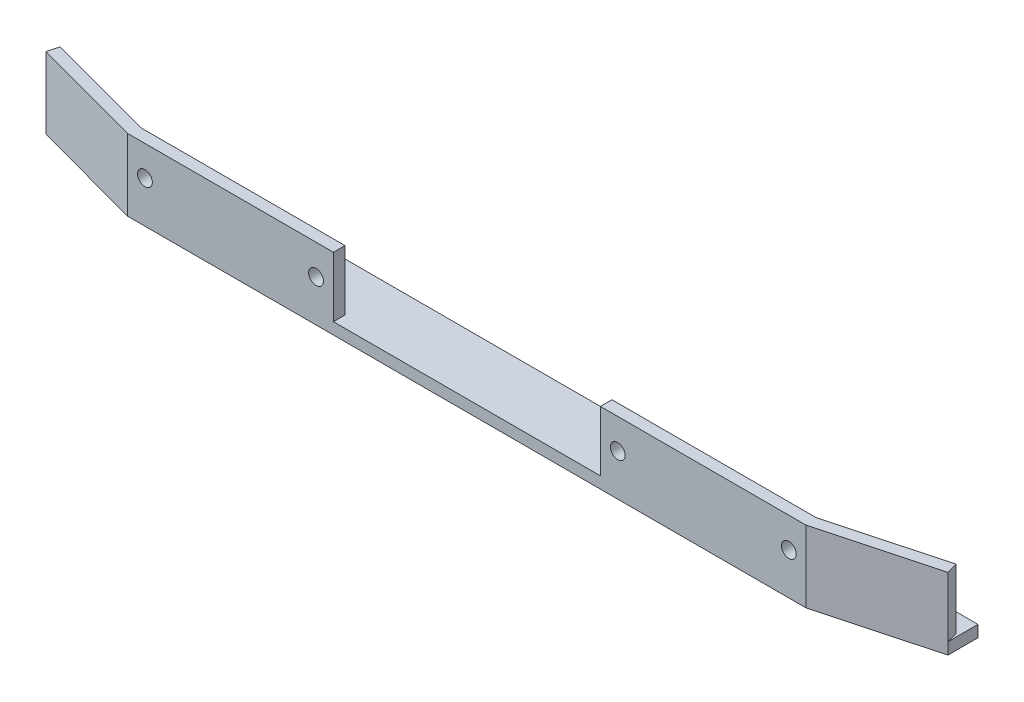
ISO-10303-21;
HEADER;
FILE_DESCRIPTION(('STEP AP214'),'2;1');
FILE_NAME('part.step','',(''),(''),'','','');
FILE_SCHEMA(('AUTOMOTIVE_DESIGN { 1 0 10303 214 1 1 1 1 }'));
ENDSEC;
DATA;
#1=APPLICATION_CONTEXT('core data for automotive mechanical design processes');
#2=APPLICATION_PROTOCOL_DEFINITION('international standard','automotive_design',2000,#1);
#3=PRODUCT_CONTEXT('',#1,'mechanical');
#4=PRODUCT('Part','Part','',(#3));
#5=PRODUCT_RELATED_PRODUCT_CATEGORY('part','',(#4));
#6=PRODUCT_DEFINITION_FORMATION('','',#4);
#7=PRODUCT_DEFINITION_CONTEXT('part definition',#1,'design');
#8=PRODUCT_DEFINITION('design','',#6,#7);
#9=PRODUCT_DEFINITION_SHAPE('','',#8);
#10=(LENGTH_UNIT() NAMED_UNIT(*) SI_UNIT(.MILLI.,.METRE.));
#11=(NAMED_UNIT(*) PLANE_ANGLE_UNIT() SI_UNIT($,.RADIAN.));
#12=(NAMED_UNIT(*) SI_UNIT($,.STERADIAN.) SOLID_ANGLE_UNIT());
#13=UNCERTAINTY_MEASURE_WITH_UNIT(LENGTH_MEASURE(1.E-05),#10,'distance_accuracy_value','');
#14=(GEOMETRIC_REPRESENTATION_CONTEXT(3) GLOBAL_UNCERTAINTY_ASSIGNED_CONTEXT((#13)) GLOBAL_UNIT_ASSIGNED_CONTEXT((#10,
#11,#12)) REPRESENTATION_CONTEXT('',''));
#15=CARTESIAN_POINT('',(0.,0.,0.));
#16=DIRECTION('',(0.,0.,1.));
#17=DIRECTION('',(1.,0.,0.));
#18=AXIS2_PLACEMENT_3D('',#15,#16,#17);
#19=CARTESIAN_POINT('',(0.,2.5,0.));
#20=DIRECTION('',(0.,1.,0.));
#21=DIRECTION('',(0.,0.,1.));
#22=AXIS2_PLACEMENT_3D('',#19,#20,#21);
#23=PLANE('',#22);
#24=CARTESIAN_POINT('',(-11.606798354676,2.5,-9.25));
#25=DIRECTION('',(0.,1.,0.));
#26=DIRECTION('',(0.,0.,1.));
#27=AXIS2_PLACEMENT_3D('',#24,#25,#26);
#28=CIRCLE('',#27,1.5);
#29=CARTESIAN_POINT('',(-11.606798354676,2.5,-7.75));
#30=VERTEX_POINT('',#29);
#31=EDGE_CURVE('E218',#30,#30,#28,.T.);
#32=ORIENTED_EDGE('',*,*,#31,.F.);
#33=EDGE_LOOP('',(#32));
#34=FACE_BOUND('',#33,.T.);
#35=CARTESIAN_POINT('',(89.393201645324,2.5,-9.25));
#36=DIRECTION('',(0.,1.,0.));
#37=DIRECTION('',(0.,0.,1.));
#38=AXIS2_PLACEMENT_3D('',#35,#36,#37);
#39=CIRCLE('',#38,1.5);
#40=CARTESIAN_POINT('',(89.393201645324,2.5,-7.75));
#41=VERTEX_POINT('',#40);
#42=EDGE_CURVE('E212',#41,#41,#39,.T.);
#43=ORIENTED_EDGE('',*,*,#42,.F.);
#44=EDGE_LOOP('',(#43));
#45=FACE_BOUND('',#44,.T.);
#46=DIRECTION('',(-0.965608616365865,0.,0.26));
#47=VECTOR('',#46,1.);
#48=CARTESIAN_POINT('',(111.92229985508,2.5,-2.5));
#49=LINE('',#48,#47);
#50=CARTESIAN_POINT('',(135.743201645324,2.5,-8.91402154091467));
#51=VERTEX_POINT('',#50);
#52=CARTESIAN_POINT('',(111.92229985508,2.5,-2.5));
#53=VERTEX_POINT('',#52);
#54=EDGE_CURVE('E50',#51,#53,#49,.T.);
#55=ORIENTED_EDGE('',*,*,#54,.F.);
#56=DIRECTION('',(-0.260000000000004,0.,-0.965608616365864));
#57=VECTOR('',#56,1.);
#58=CARTESIAN_POINT('',(135.743201645324,2.5,-8.91402154091467));
#59=LINE('',#58,#57);
#60=CARTESIAN_POINT('',(136.393201645324,2.5,-6.5));
#61=VERTEX_POINT('',#60);
#62=EDGE_CURVE('E164',#61,#51,#59,.T.);
#63=ORIENTED_EDGE('',*,*,#62,.F.);
#64=DIRECTION('',(0.,0.,-1.));
#65=VECTOR('',#64,1.);
#66=CARTESIAN_POINT('',(136.393201645324,2.5,-13.));
#67=LINE('',#66,#65);
#68=CARTESIAN_POINT('',(136.393201645324,2.5,-13.));
#69=VERTEX_POINT('',#68);
#70=EDGE_CURVE('E229',#61,#69,#67,.T.);
#71=ORIENTED_EDGE('',*,*,#70,.T.);
#72=DIRECTION('',(-1.,0.,0.));
#73=VECTOR('',#72,1.);
#74=CARTESIAN_POINT('',(-58.606798354676,2.5,-13.));
#75=LINE('',#74,#73);
#76=CARTESIAN_POINT('',(-58.606798354676,2.5,-13.));
#77=VERTEX_POINT('',#76);
#78=EDGE_CURVE('E231',#69,#77,#75,.T.);
#79=ORIENTED_EDGE('',*,*,#78,.T.);
#80=DIRECTION('',(0.,0.,1.));
#81=VECTOR('',#80,1.);
#82=CARTESIAN_POINT('',(-58.606798354676,2.5,-13.));
#83=LINE('',#82,#81);
#84=CARTESIAN_POINT('',(-58.606798354676,2.5,-6.5));
#85=VERTEX_POINT('',#84);
#86=EDGE_CURVE('E224',#77,#85,#83,.T.);
#87=ORIENTED_EDGE('',*,*,#86,.T.);
#88=DIRECTION('',(-0.259999999999999,0.,0.965608616365865));
#89=VECTOR('',#88,1.);
#90=CARTESIAN_POINT('',(-57.956798354676,2.5,-8.91402154091466));
#91=LINE('',#90,#89);
#92=CARTESIAN_POINT('',(-57.956798354676,2.5,-8.91402154091466));
#93=VERTEX_POINT('',#92);
#94=EDGE_CURVE('E165',#93,#85,#91,.T.);
#95=ORIENTED_EDGE('',*,*,#94,.F.);
#96=DIRECTION('',(-0.965608616365865,0.,-0.26));
#97=VECTOR('',#96,1.);
#98=CARTESIAN_POINT('',(-34.135896564432,2.5,-2.50000000000001));
#99=LINE('',#98,#97);
#100=CARTESIAN_POINT('',(-34.135896564432,2.5,-2.50000000000001));
#101=VERTEX_POINT('',#100);
#102=EDGE_CURVE('E178',#101,#93,#99,.T.);
#103=ORIENTED_EDGE('',*,*,#102,.F.);
#104=DIRECTION('',(-1.,0.,0.));
#105=VECTOR('',#104,1.);
#106=CARTESIAN_POINT('',(10.0334170544706,2.5,-2.50000000000001));
#107=LINE('',#106,#105);
#108=CARTESIAN_POINT('',(10.0334170544706,2.5,-2.50000000000001));
#109=VERTEX_POINT('',#108);
#110=EDGE_CURVE('E192',#109,#101,#107,.T.);
#111=ORIENTED_EDGE('',*,*,#110,.F.);
#112=DIRECTION('',(0.,0.,-1.));
#113=VECTOR('',#112,1.);
#114=CARTESIAN_POINT('',(10.0334170544706,2.5,0.));
#115=LINE('',#114,#113);
#116=CARTESIAN_POINT('',(10.0334170544706,2.5,0.));
#117=VERTEX_POINT('',#116);
#118=EDGE_CURVE('E168',#117,#109,#115,.T.);
#119=ORIENTED_EDGE('',*,*,#118,.F.);
#120=DIRECTION('',(1.,0.,0.));
#121=VECTOR('',#120,1.);
#122=CARTESIAN_POINT('',(-34.4665829455294,2.5,0.));
#123=LINE('',#122,#121);
#124=CARTESIAN_POINT('',(67.7529862361773,2.5,0.));
#125=VERTEX_POINT('',#124);
#126=EDGE_CURVE('E226',#117,#125,#123,.T.);
#127=ORIENTED_EDGE('',*,*,#126,.T.);
#128=DIRECTION('',(0.,0.,1.));
#129=VECTOR('',#128,1.);
#130=CARTESIAN_POINT('',(67.7529862361773,2.5,0.));
#131=LINE('',#130,#129);
#132=CARTESIAN_POINT('',(67.7529862361773,2.5,-2.5));
#133=VERTEX_POINT('',#132);
#134=EDGE_CURVE('E161',#133,#125,#131,.T.);
#135=ORIENTED_EDGE('',*,*,#134,.F.);
#136=DIRECTION('',(-1.,0.,0.));
#137=VECTOR('',#136,1.);
#138=CARTESIAN_POINT('',(67.7529862361773,2.5,-2.5));
#139=LINE('',#138,#137);
#140=EDGE_CURVE('E55',#53,#133,#139,.T.);
#141=ORIENTED_EDGE('',*,*,#140,.F.);
#142=EDGE_LOOP('',(#55,#63,#71,#79,#87,#95,#103,#111,#119,#127,#135,#141));
#143=FACE_BOUND('',#142,.T.);
#144=ADVANCED_FACE('F33',(#34,#45,#143),#23,.T.);
#145=CARTESIAN_POINT('',(0.,0.,0.));
#146=DIRECTION('',(0.,1.,0.));
#147=DIRECTION('',(0.,0.,1.));
#148=AXIS2_PLACEMENT_3D('',#145,#146,#147);
#149=PLANE('',#148);
#150=DIRECTION('',(0.,0.,1.));
#151=VECTOR('',#150,1.);
#152=CARTESIAN_POINT('',(-58.606798354676,0.,-13.));
#153=LINE('',#152,#151);
#154=CARTESIAN_POINT('',(-58.606798354676,0.,-13.));
#155=VERTEX_POINT('',#154);
#156=CARTESIAN_POINT('',(-58.606798354676,0.,-6.5));
#157=VERTEX_POINT('',#156);
#158=EDGE_CURVE('E221',#155,#157,#153,.T.);
#159=ORIENTED_EDGE('',*,*,#158,.F.);
#160=DIRECTION('',(-1.,0.,0.));
#161=VECTOR('',#160,1.);
#162=CARTESIAN_POINT('',(-58.606798354676,0.,-13.));
#163=LINE('',#162,#161);
#164=CARTESIAN_POINT('',(136.393201645324,0.,-13.));
#165=VERTEX_POINT('',#164);
#166=EDGE_CURVE('E227',#165,#155,#163,.T.);
#167=ORIENTED_EDGE('',*,*,#166,.F.);
#168=DIRECTION('',(0.,0.,-1.));
#169=VECTOR('',#168,1.);
#170=CARTESIAN_POINT('',(136.393201645324,0.,-13.));
#171=LINE('',#170,#169);
#172=CARTESIAN_POINT('',(136.393201645324,0.,-6.5));
#173=VERTEX_POINT('',#172);
#174=EDGE_CURVE('E242',#173,#165,#171,.T.);
#175=ORIENTED_EDGE('',*,*,#174,.F.);
#176=DIRECTION('',(0.965608616365865,0.,-0.26));
#177=VECTOR('',#176,1.);
#178=CARTESIAN_POINT('',(136.393201645324,0.,-6.5));
#179=LINE('',#178,#177);
#180=CARTESIAN_POINT('',(112.252986236177,0.,0.));
#181=VERTEX_POINT('',#180);
#182=EDGE_CURVE('E240',#181,#173,#179,.T.);
#183=ORIENTED_EDGE('',*,*,#182,.F.);
#184=DIRECTION('',(1.,0.,0.));
#185=VECTOR('',#184,1.);
#186=CARTESIAN_POINT('',(-34.4665829455294,0.,0.));
#187=LINE('',#186,#185);
#188=CARTESIAN_POINT('',(-34.4665829455294,0.,0.));
#189=VERTEX_POINT('',#188);
#190=EDGE_CURVE('E238',#189,#181,#187,.T.);
#191=ORIENTED_EDGE('',*,*,#190,.F.);
#192=DIRECTION('',(0.965608616365865,0.,0.26));
#193=VECTOR('',#192,1.);
#194=CARTESIAN_POINT('',(-58.606798354676,0.,-6.5));
#195=LINE('',#194,#193);
#196=EDGE_CURVE('E236',#157,#189,#195,.T.);
#197=ORIENTED_EDGE('',*,*,#196,.F.);
#198=EDGE_LOOP('',(#159,#167,#175,#183,#191,#197));
#199=FACE_BOUND('',#198,.T.);
#200=CARTESIAN_POINT('',(-11.606798354676,0.,-9.25));
#201=DIRECTION('',(0.,1.,0.));
#202=DIRECTION('',(0.,0.,1.));
#203=AXIS2_PLACEMENT_3D('',#200,#201,#202);
#204=CIRCLE('',#203,1.5);
#205=CARTESIAN_POINT('',(-11.606798354676,0.,-7.75));
#206=VERTEX_POINT('',#205);
#207=EDGE_CURVE('E215',#206,#206,#204,.T.);
#208=ORIENTED_EDGE('',*,*,#207,.T.);
#209=EDGE_LOOP('',(#208));
#210=FACE_BOUND('',#209,.T.);
#211=CARTESIAN_POINT('',(89.393201645324,0.,-9.25));
#212=DIRECTION('',(0.,1.,0.));
#213=DIRECTION('',(0.,0.,1.));
#214=AXIS2_PLACEMENT_3D('',#211,#212,#213);
#215=CIRCLE('',#214,1.5);
#216=CARTESIAN_POINT('',(89.393201645324,0.,-7.75));
#217=VERTEX_POINT('',#216);
#218=EDGE_CURVE('E211',#217,#217,#215,.T.);
#219=ORIENTED_EDGE('',*,*,#218,.T.);
#220=EDGE_LOOP('',(#219));
#221=FACE_BOUND('',#220,.T.);
#222=ADVANCED_FACE('F315',(#199,#210,#221),#149,.F.);
#223=CARTESIAN_POINT('',(-58.606798354676,2.5,-13.));
#224=DIRECTION('',(1.,0.,0.));
#225=DIRECTION('',(0.,0.,-1.));
#226=AXIS2_PLACEMENT_3D('',#223,#224,#225);
#227=PLANE('',#226);
#228=ORIENTED_EDGE('',*,*,#158,.T.);
#229=DIRECTION('',(0.,-1.,0.));
#230=VECTOR('',#229,1.);
#231=CARTESIAN_POINT('',(-58.606798354676,2.5,-6.5));
#232=LINE('',#231,#230);
#233=EDGE_CURVE('E11',#85,#157,#232,.T.);
#234=ORIENTED_EDGE('',*,*,#233,.F.);
#235=ORIENTED_EDGE('',*,*,#86,.F.);
#236=DIRECTION('',(0.,-1.,0.));
#237=VECTOR('',#236,1.);
#238=CARTESIAN_POINT('',(-58.606798354676,2.5,-13.));
#239=LINE('',#238,#237);
#240=EDGE_CURVE('E233',#77,#155,#239,.T.);
#241=ORIENTED_EDGE('',*,*,#240,.T.);
#242=EDGE_LOOP('',(#228,#234,#235,#241));
#243=FACE_BOUND('',#242,.T.);
#244=ADVANCED_FACE('F35',(#243),#227,.F.);
#245=CARTESIAN_POINT('',(-58.606798354676,2.5,-6.5));
#246=DIRECTION('',(0.26,0.,-0.965608616365865));
#247=DIRECTION('',(-0.965608616365865,0.,-0.26));
#248=AXIS2_PLACEMENT_3D('',#245,#246,#247);
#249=PLANE('',#248);
#250=ORIENTED_EDGE('',*,*,#196,.T.);
#251=DIRECTION('',(0.,-1.,0.));
#252=VECTOR('',#251,1.);
#253=CARTESIAN_POINT('',(-34.4665829455294,2.5,0.));
#254=LINE('',#253,#252);
#255=CARTESIAN_POINT('',(-34.4665829455294,15.5,0.));
#256=VERTEX_POINT('',#255);
#257=EDGE_CURVE('E42',#256,#189,#254,.T.);
#258=ORIENTED_EDGE('',*,*,#257,.F.);
#259=DIRECTION('',(0.965608616365865,0.,0.26));
#260=VECTOR('',#259,1.);
#261=CARTESIAN_POINT('',(-58.606798354676,15.5,-6.5));
#262=LINE('',#261,#260);
#263=CARTESIAN_POINT('',(-58.606798354676,15.5,-6.5));
#264=VERTEX_POINT('',#263);
#265=EDGE_CURVE('E177',#264,#256,#262,.T.);
#266=ORIENTED_EDGE('',*,*,#265,.F.);
#267=DIRECTION('',(0.,-1.,0.));
#268=VECTOR('',#267,1.);
#269=CARTESIAN_POINT('',(-58.606798354676,15.5,-6.5));
#270=LINE('',#269,#268);
#271=EDGE_CURVE('E208',#264,#85,#270,.T.);
#272=ORIENTED_EDGE('',*,*,#271,.T.);
#273=ORIENTED_EDGE('',*,*,#233,.T.);
#274=EDGE_LOOP('',(#250,#258,#266,#272,#273));
#275=FACE_BOUND('',#274,.T.);
#276=ADVANCED_FACE('F330',(#275),#249,.F.);
#277=CARTESIAN_POINT('',(-34.4665829455294,2.5,0.));
#278=DIRECTION('',(0.,0.,-1.));
#279=DIRECTION('',(-1.,0.,0.));
#280=AXIS2_PLACEMENT_3D('',#277,#278,#279);
#281=PLANE('',#280);
#282=CARTESIAN_POINT('',(6.2834170544706,9.,0.));
#283=DIRECTION('',(0.,0.,1.));
#284=DIRECTION('',(1.,0.,0.));
#285=AXIS2_PLACEMENT_3D('',#282,#283,#284);
#286=CIRCLE('',#285,1.6);
#287=CARTESIAN_POINT('',(7.8834170544706,9.,0.));
#288=VERTEX_POINT('',#287);
#289=EDGE_CURVE('E265',#288,#288,#286,.T.);
#290=ORIENTED_EDGE('',*,*,#289,.F.);
#291=EDGE_LOOP('',(#290));
#292=FACE_BOUND('',#291,.T.);
#293=CARTESIAN_POINT('',(71.5029862361774,9.,0.));
#294=DIRECTION('',(0.,0.,1.));
#295=DIRECTION('',(1.,0.,0.));
#296=AXIS2_PLACEMENT_3D('',#293,#294,#295);
#297=CIRCLE('',#296,1.6);
#298=CARTESIAN_POINT('',(73.1029862361774,9.,0.));
#299=VERTEX_POINT('',#298);
#300=EDGE_CURVE('E562',#299,#299,#297,.T.);
#301=ORIENTED_EDGE('',*,*,#300,.F.);
#302=EDGE_LOOP('',(#301));
#303=FACE_BOUND('',#302,.T.);
#304=CARTESIAN_POINT('',(108.502986236177,9.,0.));
#305=DIRECTION('',(0.,0.,1.));
#306=DIRECTION('',(1.,0.,0.));
#307=AXIS2_PLACEMENT_3D('',#304,#305,#306);
#308=CIRCLE('',#307,1.6);
#309=CARTESIAN_POINT('',(110.102986236177,9.,0.));
#310=VERTEX_POINT('',#309);
#311=EDGE_CURVE('E277',#310,#310,#308,.T.);
#312=ORIENTED_EDGE('',*,*,#311,.F.);
#313=EDGE_LOOP('',(#312));
#314=FACE_BOUND('',#313,.T.);
#315=CARTESIAN_POINT('',(-30.7165829455294,9.,0.));
#316=DIRECTION('',(0.,0.,1.));
#317=DIRECTION('',(1.,0.,0.));
#318=AXIS2_PLACEMENT_3D('',#315,#316,#317);
#319=CIRCLE('',#318,1.6);
#320=CARTESIAN_POINT('',(-29.1165829455294,9.,0.));
#321=VERTEX_POINT('',#320);
#322=EDGE_CURVE('E261',#321,#321,#319,.T.);
#323=ORIENTED_EDGE('',*,*,#322,.F.);
#324=EDGE_LOOP('',(#323));
#325=FACE_BOUND('',#324,.T.);
#326=ORIENTED_EDGE('',*,*,#190,.T.);
#327=DIRECTION('',(0.,-1.,0.));
#328=VECTOR('',#327,1.);
#329=CARTESIAN_POINT('',(112.252986236177,2.5,0.));
#330=LINE('',#329,#328);
#331=CARTESIAN_POINT('',(112.252986236177,15.5,0.));
#332=VERTEX_POINT('',#331);
#333=EDGE_CURVE('E253',#332,#181,#330,.T.);
#334=ORIENTED_EDGE('',*,*,#333,.F.);
#335=DIRECTION('',(1.,0.,0.));
#336=VECTOR('',#335,1.);
#337=CARTESIAN_POINT('',(112.252986236177,15.5,0.));
#338=LINE('',#337,#336);
#339=CARTESIAN_POINT('',(67.7529862361773,15.5,0.));
#340=VERTEX_POINT('',#339);
#341=EDGE_CURVE('E283',#340,#332,#338,.T.);
#342=ORIENTED_EDGE('',*,*,#341,.F.);
#343=DIRECTION('',(0.,-1.,0.));
#344=VECTOR('',#343,1.);
#345=CARTESIAN_POINT('',(67.7529862361773,15.5,0.));
#346=LINE('',#345,#344);
#347=EDGE_CURVE('E293',#340,#125,#346,.T.);
#348=ORIENTED_EDGE('',*,*,#347,.T.);
#349=ORIENTED_EDGE('',*,*,#126,.F.);
#350=DIRECTION('',(0.,-1.,0.));
#351=VECTOR('',#350,1.);
#352=CARTESIAN_POINT('',(10.0334170544706,15.5,0.));
#353=LINE('',#352,#351);
#354=CARTESIAN_POINT('',(10.0334170544706,15.5,0.));
#355=VERTEX_POINT('',#354);
#356=EDGE_CURVE('E205',#355,#117,#353,.T.);
#357=ORIENTED_EDGE('',*,*,#356,.F.);
#358=DIRECTION('',(1.,0.,0.));
#359=VECTOR('',#358,1.);
#360=CARTESIAN_POINT('',(-34.4665829455294,15.5,0.));
#361=LINE('',#360,#359);
#362=EDGE_CURVE('E181',#256,#355,#361,.T.);
#363=ORIENTED_EDGE('',*,*,#362,.F.);
#364=ORIENTED_EDGE('',*,*,#257,.T.);
#365=EDGE_LOOP('',(#326,#334,#342,#348,#349,#357,#363,#364));
#366=FACE_BOUND('',#365,.T.);
#367=ADVANCED_FACE('F306',(#292,#303,#314,#325,#366),#281,.F.);
#368=CARTESIAN_POINT('',(136.393201645324,2.5,-6.5));
#369=DIRECTION('',(-0.26,0.,-0.965608616365865));
#370=DIRECTION('',(-0.965608616365865,0.,0.26));
#371=AXIS2_PLACEMENT_3D('',#368,#369,#370);
#372=PLANE('',#371);
#373=ORIENTED_EDGE('',*,*,#182,.T.);
#374=DIRECTION('',(0.,-1.,0.));
#375=VECTOR('',#374,1.);
#376=CARTESIAN_POINT('',(136.393201645324,2.5,-6.5));
#377=LINE('',#376,#375);
#378=EDGE_CURVE('E250',#61,#173,#377,.T.);
#379=ORIENTED_EDGE('',*,*,#378,.F.);
#380=DIRECTION('',(0.,-1.,0.));
#381=VECTOR('',#380,1.);
#382=CARTESIAN_POINT('',(136.393201645324,15.5,-6.5));
#383=LINE('',#382,#381);
#384=CARTESIAN_POINT('',(136.393201645324,15.5,-6.5));
#385=VERTEX_POINT('',#384);
#386=EDGE_CURVE('E286',#385,#61,#383,.T.);
#387=ORIENTED_EDGE('',*,*,#386,.F.);
#388=DIRECTION('',(0.965608616365865,0.,-0.26));
#389=VECTOR('',#388,1.);
#390=CARTESIAN_POINT('',(136.393201645324,15.5,-6.5));
#391=LINE('',#390,#389);
#392=EDGE_CURVE('E157',#332,#385,#391,.T.);
#393=ORIENTED_EDGE('',*,*,#392,.F.);
#394=ORIENTED_EDGE('',*,*,#333,.T.);
#395=EDGE_LOOP('',(#373,#379,#387,#393,#394));
#396=FACE_BOUND('',#395,.T.);
#397=ADVANCED_FACE('F310',(#396),#372,.F.);
#398=CARTESIAN_POINT('',(136.393201645324,2.5,-13.));
#399=DIRECTION('',(-1.,0.,0.));
#400=DIRECTION('',(0.,0.,1.));
#401=AXIS2_PLACEMENT_3D('',#398,#399,#400);
#402=PLANE('',#401);
#403=ORIENTED_EDGE('',*,*,#174,.T.);
#404=DIRECTION('',(0.,-1.,0.));
#405=VECTOR('',#404,1.);
#406=CARTESIAN_POINT('',(136.393201645324,2.5,-13.));
#407=LINE('',#406,#405);
#408=EDGE_CURVE('E247',#69,#165,#407,.T.);
#409=ORIENTED_EDGE('',*,*,#408,.F.);
#410=ORIENTED_EDGE('',*,*,#70,.F.);
#411=ORIENTED_EDGE('',*,*,#378,.T.);
#412=EDGE_LOOP('',(#403,#409,#410,#411));
#413=FACE_BOUND('',#412,.T.);
#414=ADVANCED_FACE('F320',(#413),#402,.F.);
#415=CARTESIAN_POINT('',(-58.606798354676,2.5,-13.));
#416=DIRECTION('',(0.,0.,1.));
#417=DIRECTION('',(1.,0.,0.));
#418=AXIS2_PLACEMENT_3D('',#415,#416,#417);
#419=PLANE('',#418);
#420=ORIENTED_EDGE('',*,*,#166,.T.);
#421=ORIENTED_EDGE('',*,*,#240,.F.);
#422=ORIENTED_EDGE('',*,*,#78,.F.);
#423=ORIENTED_EDGE('',*,*,#408,.T.);
#424=EDGE_LOOP('',(#420,#421,#422,#423));
#425=FACE_BOUND('',#424,.T.);
#426=ADVANCED_FACE('F323',(#425),#419,.F.);
#427=CARTESIAN_POINT('',(-11.606798354676,2.5,-9.25));
#428=DIRECTION('',(0.,-1.,0.));
#429=DIRECTION('',(0.,0.,-1.));
#430=AXIS2_PLACEMENT_3D('',#427,#428,#429);
#431=CYLINDRICAL_SURFACE('',#430,1.5);
#432=ORIENTED_EDGE('',*,*,#31,.T.);
#433=EDGE_LOOP('',(#432));
#434=FACE_BOUND('',#433,.T.);
#435=ORIENTED_EDGE('',*,*,#207,.F.);
#436=EDGE_LOOP('',(#435));
#437=FACE_BOUND('',#436,.T.);
#438=ADVANCED_FACE('F368',(#434,#437),#431,.F.);
#439=CARTESIAN_POINT('',(89.393201645324,2.5,-9.25));
#440=DIRECTION('',(0.,-1.,0.));
#441=DIRECTION('',(0.,0.,-1.));
#442=AXIS2_PLACEMENT_3D('',#439,#440,#441);
#443=CYLINDRICAL_SURFACE('',#442,1.5);
#444=ORIENTED_EDGE('',*,*,#42,.T.);
#445=EDGE_LOOP('',(#444));
#446=FACE_BOUND('',#445,.T.);
#447=ORIENTED_EDGE('',*,*,#218,.F.);
#448=EDGE_LOOP('',(#447));
#449=FACE_BOUND('',#448,.T.);
#450=ADVANCED_FACE('F411',(#446,#449),#443,.F.);
#451=CARTESIAN_POINT('',(-57.956798354676,15.5,-8.91402154091466));
#452=DIRECTION('',(0.965608616365865,0.,0.259999999999999));
#453=DIRECTION('',(0.259999999999999,0.,-0.965608616365865));
#454=AXIS2_PLACEMENT_3D('',#451,#452,#453);
#455=PLANE('',#454);
#456=ORIENTED_EDGE('',*,*,#94,.T.);
#457=ORIENTED_EDGE('',*,*,#271,.F.);
#458=DIRECTION('',(-0.259999999999999,0.,0.965608616365865));
#459=VECTOR('',#458,1.);
#460=CARTESIAN_POINT('',(-57.956798354676,15.5,-8.91402154091466));
#461=LINE('',#460,#459);
#462=CARTESIAN_POINT('',(-57.956798354676,15.5,-8.91402154091466));
#463=VERTEX_POINT('',#462);
#464=EDGE_CURVE('E174',#463,#264,#461,.T.);
#465=ORIENTED_EDGE('',*,*,#464,.F.);
#466=DIRECTION('',(0.,-1.,0.));
#467=VECTOR('',#466,1.);
#468=CARTESIAN_POINT('',(-57.956798354676,15.5,-8.91402154091466));
#469=LINE('',#468,#467);
#470=EDGE_CURVE('E188',#463,#93,#469,.T.);
#471=ORIENTED_EDGE('',*,*,#470,.T.);
#472=EDGE_LOOP('',(#456,#457,#465,#471));
#473=FACE_BOUND('',#472,.T.);
#474=ADVANCED_FACE('F333',(#473),#455,.F.);
#475=CARTESIAN_POINT('',(10.0334170544706,15.5,0.));
#476=DIRECTION('',(-1.,0.,0.));
#477=DIRECTION('',(0.,0.,1.));
#478=AXIS2_PLACEMENT_3D('',#475,#476,#477);
#479=PLANE('',#478);
#480=ORIENTED_EDGE('',*,*,#118,.T.);
#481=DIRECTION('',(0.,-1.,0.));
#482=VECTOR('',#481,1.);
#483=CARTESIAN_POINT('',(10.0334170544706,15.5,-2.50000000000001));
#484=LINE('',#483,#482);
#485=CARTESIAN_POINT('',(10.0334170544706,15.5,-2.50000000000001));
#486=VERTEX_POINT('',#485);
#487=EDGE_CURVE('E202',#486,#109,#484,.T.);
#488=ORIENTED_EDGE('',*,*,#487,.F.);
#489=DIRECTION('',(0.,0.,-1.));
#490=VECTOR('',#489,1.);
#491=CARTESIAN_POINT('',(10.0334170544706,15.5,0.));
#492=LINE('',#491,#490);
#493=EDGE_CURVE('E183',#355,#486,#492,.T.);
#494=ORIENTED_EDGE('',*,*,#493,.F.);
#495=ORIENTED_EDGE('',*,*,#356,.T.);
#496=EDGE_LOOP('',(#480,#488,#494,#495));
#497=FACE_BOUND('',#496,.T.);
#498=ADVANCED_FACE('F345',(#497),#479,.F.);
#499=CARTESIAN_POINT('',(10.0334170544706,15.5,-2.50000000000001));
#500=DIRECTION('',(0.,0.,1.));
#501=DIRECTION('',(1.,0.,0.));
#502=AXIS2_PLACEMENT_3D('',#499,#500,#501);
#503=PLANE('',#502);
#504=CARTESIAN_POINT('',(6.2834170544706,9.,-2.50000000000001));
#505=DIRECTION('',(0.,0.,1.));
#506=DIRECTION('',(1.,0.,0.));
#507=AXIS2_PLACEMENT_3D('',#504,#505,#506);
#508=CIRCLE('',#507,1.6);
#509=CARTESIAN_POINT('',(7.8834170544706,9.,-2.50000000000001));
#510=VERTEX_POINT('',#509);
#511=EDGE_CURVE('E37',#510,#510,#508,.T.);
#512=ORIENTED_EDGE('',*,*,#511,.T.);
#513=EDGE_LOOP('',(#512));
#514=FACE_BOUND('',#513,.T.);
#515=CARTESIAN_POINT('',(-30.7165829455294,9.,-2.50000000000001));
#516=DIRECTION('',(0.,0.,1.));
#517=DIRECTION('',(1.,0.,0.));
#518=AXIS2_PLACEMENT_3D('',#515,#516,#517);
#519=CIRCLE('',#518,1.6);
#520=CARTESIAN_POINT('',(-29.1165829455294,9.,-2.50000000000001));
#521=VERTEX_POINT('',#520);
#522=EDGE_CURVE('E258',#521,#521,#519,.T.);
#523=ORIENTED_EDGE('',*,*,#522,.T.);
#524=EDGE_LOOP('',(#523));
#525=FACE_BOUND('',#524,.T.);
#526=ORIENTED_EDGE('',*,*,#110,.T.);
#527=DIRECTION('',(0.,-1.,0.));
#528=VECTOR('',#527,1.);
#529=CARTESIAN_POINT('',(-34.135896564432,15.5,-2.50000000000001));
#530=LINE('',#529,#528);
#531=CARTESIAN_POINT('',(-34.135896564432,15.5,-2.50000000000001));
#532=VERTEX_POINT('',#531);
#533=EDGE_CURVE('E199',#532,#101,#530,.T.);
#534=ORIENTED_EDGE('',*,*,#533,.F.);
#535=DIRECTION('',(-1.,0.,0.));
#536=VECTOR('',#535,1.);
#537=CARTESIAN_POINT('',(10.0334170544706,15.5,-2.50000000000001));
#538=LINE('',#537,#536);
#539=EDGE_CURVE('E185',#486,#532,#538,.T.);
#540=ORIENTED_EDGE('',*,*,#539,.F.);
#541=ORIENTED_EDGE('',*,*,#487,.T.);
#542=EDGE_LOOP('',(#526,#534,#540,#541));
#543=FACE_BOUND('',#542,.T.);
#544=ADVANCED_FACE('F340',(#514,#525,#543),#503,.F.);
#545=CARTESIAN_POINT('',(-34.135896564432,15.5,-2.50000000000001));
#546=DIRECTION('',(-0.26,0.,0.965608616365865));
#547=DIRECTION('',(0.965608616365865,0.,0.26));
#548=AXIS2_PLACEMENT_3D('',#545,#546,#547);
#549=PLANE('',#548);
#550=ORIENTED_EDGE('',*,*,#102,.T.);
#551=ORIENTED_EDGE('',*,*,#470,.F.);
#552=DIRECTION('',(-0.965608616365865,0.,-0.26));
#553=VECTOR('',#552,1.);
#554=CARTESIAN_POINT('',(-34.135896564432,15.5,-2.50000000000001));
#555=LINE('',#554,#553);
#556=EDGE_CURVE('E187',#532,#463,#555,.T.);
#557=ORIENTED_EDGE('',*,*,#556,.F.);
#558=ORIENTED_EDGE('',*,*,#533,.T.);
#559=EDGE_LOOP('',(#550,#551,#557,#558));
#560=FACE_BOUND('',#559,.T.);
#561=ADVANCED_FACE('F337',(#560),#549,.F.);
#562=CARTESIAN_POINT('',(0.,15.5,0.));
#563=DIRECTION('',(0.,1.,0.));
#564=DIRECTION('',(0.,0.,1.));
#565=AXIS2_PLACEMENT_3D('',#562,#563,#564);
#566=PLANE('',#565);
#567=ORIENTED_EDGE('',*,*,#464,.T.);
#568=ORIENTED_EDGE('',*,*,#265,.T.);
#569=ORIENTED_EDGE('',*,*,#362,.T.);
#570=ORIENTED_EDGE('',*,*,#493,.T.);
#571=ORIENTED_EDGE('',*,*,#539,.T.);
#572=ORIENTED_EDGE('',*,*,#556,.T.);
#573=EDGE_LOOP('',(#567,#568,#569,#570,#571,#572));
#574=FACE_BOUND('',#573,.T.);
#575=ADVANCED_FACE('F349',(#574),#566,.T.);
#576=CARTESIAN_POINT('',(135.743201645324,15.5,-8.91402154091467));
#577=DIRECTION('',(-0.965608616365864,0.,0.260000000000004));
#578=DIRECTION('',(0.260000000000004,0.,0.965608616365864));
#579=AXIS2_PLACEMENT_3D('',#576,#577,#578);
#580=PLANE('',#579);
#581=ORIENTED_EDGE('',*,*,#62,.T.);
#582=DIRECTION('',(0.,-1.,0.));
#583=VECTOR('',#582,1.);
#584=CARTESIAN_POINT('',(135.743201645324,15.5,-8.91402154091467));
#585=LINE('',#584,#583);
#586=CARTESIAN_POINT('',(135.743201645324,15.5,-8.91402154091467));
#587=VERTEX_POINT('',#586);
#588=EDGE_CURVE('E144',#587,#51,#585,.T.);
#589=ORIENTED_EDGE('',*,*,#588,.F.);
#590=DIRECTION('',(-0.260000000000004,0.,-0.965608616365864));
#591=VECTOR('',#590,1.);
#592=CARTESIAN_POINT('',(135.743201645324,15.5,-8.91402154091467));
#593=LINE('',#592,#591);
#594=EDGE_CURVE('E151',#385,#587,#593,.T.);
#595=ORIENTED_EDGE('',*,*,#594,.F.);
#596=ORIENTED_EDGE('',*,*,#386,.T.);
#597=EDGE_LOOP('',(#581,#589,#595,#596));
#598=FACE_BOUND('',#597,.T.);
#599=ADVANCED_FACE('F163',(#598),#580,.F.);
#600=CARTESIAN_POINT('',(111.92229985508,15.5,-2.5));
#601=DIRECTION('',(0.26,0.,0.965608616365865));
#602=DIRECTION('',(0.965608616365865,0.,-0.26));
#603=AXIS2_PLACEMENT_3D('',#600,#601,#602);
#604=PLANE('',#603);
#605=ORIENTED_EDGE('',*,*,#54,.T.);
#606=DIRECTION('',(0.,-1.,0.));
#607=VECTOR('',#606,1.);
#608=CARTESIAN_POINT('',(111.92229985508,15.5,-2.5));
#609=LINE('',#608,#607);
#610=CARTESIAN_POINT('',(111.92229985508,15.5,-2.5));
#611=VERTEX_POINT('',#610);
#612=EDGE_CURVE('E147',#611,#53,#609,.T.);
#613=ORIENTED_EDGE('',*,*,#612,.F.);
#614=DIRECTION('',(-0.965608616365865,0.,0.26));
#615=VECTOR('',#614,1.);
#616=CARTESIAN_POINT('',(111.92229985508,15.5,-2.5));
#617=LINE('',#616,#615);
#618=EDGE_CURVE('E140',#587,#611,#617,.T.);
#619=ORIENTED_EDGE('',*,*,#618,.F.);
#620=ORIENTED_EDGE('',*,*,#588,.T.);
#621=EDGE_LOOP('',(#605,#613,#619,#620));
#622=FACE_BOUND('',#621,.T.);
#623=ADVANCED_FACE('F142',(#622),#604,.F.);
#624=CARTESIAN_POINT('',(67.7529862361773,15.5,-2.5));
#625=DIRECTION('',(0.,0.,1.));
#626=DIRECTION('',(1.,0.,0.));
#627=AXIS2_PLACEMENT_3D('',#624,#625,#626);
#628=PLANE('',#627);
#629=CARTESIAN_POINT('',(71.5029862361774,9.,-2.5));
#630=DIRECTION('',(0.,0.,1.));
#631=DIRECTION('',(1.,0.,0.));
#632=AXIS2_PLACEMENT_3D('',#629,#630,#631);
#633=CIRCLE('',#632,1.6);
#634=CARTESIAN_POINT('',(73.1029862361774,9.,-2.5));
#635=VERTEX_POINT('',#634);
#636=EDGE_CURVE('E264',#635,#635,#633,.T.);
#637=ORIENTED_EDGE('',*,*,#636,.T.);
#638=EDGE_LOOP('',(#637));
#639=FACE_BOUND('',#638,.T.);
#640=CARTESIAN_POINT('',(108.502986236177,9.,-2.5));
#641=DIRECTION('',(0.,0.,1.));
#642=DIRECTION('',(1.,0.,0.));
#643=AXIS2_PLACEMENT_3D('',#640,#641,#642);
#644=CIRCLE('',#643,1.6);
#645=CARTESIAN_POINT('',(110.102986236177,9.,-2.5));
#646=VERTEX_POINT('',#645);
#647=EDGE_CURVE('E262',#646,#646,#644,.T.);
#648=ORIENTED_EDGE('',*,*,#647,.T.);
#649=EDGE_LOOP('',(#648));
#650=FACE_BOUND('',#649,.T.);
#651=ORIENTED_EDGE('',*,*,#140,.T.);
#652=DIRECTION('',(0.,-1.,0.));
#653=VECTOR('',#652,1.);
#654=CARTESIAN_POINT('',(67.7529862361773,15.5,-2.5));
#655=LINE('',#654,#653);
#656=CARTESIAN_POINT('',(67.7529862361773,15.5,-2.5));
#657=VERTEX_POINT('',#656);
#658=EDGE_CURVE('E170',#657,#133,#655,.T.);
#659=ORIENTED_EDGE('',*,*,#658,.F.);
#660=DIRECTION('',(-1.,0.,0.));
#661=VECTOR('',#660,1.);
#662=CARTESIAN_POINT('',(67.7529862361773,15.5,-2.5));
#663=LINE('',#662,#661);
#664=EDGE_CURVE('E150',#611,#657,#663,.T.);
#665=ORIENTED_EDGE('',*,*,#664,.F.);
#666=ORIENTED_EDGE('',*,*,#612,.T.);
#667=EDGE_LOOP('',(#651,#659,#665,#666));
#668=FACE_BOUND('',#667,.T.);
#669=ADVANCED_FACE('F302',(#639,#650,#668),#628,.F.);
#670=CARTESIAN_POINT('',(67.7529862361773,15.5,0.));
#671=DIRECTION('',(1.,0.,0.));
#672=DIRECTION('',(0.,0.,-1.));
#673=AXIS2_PLACEMENT_3D('',#670,#671,#672);
#674=PLANE('',#673);
#675=ORIENTED_EDGE('',*,*,#134,.T.);
#676=ORIENTED_EDGE('',*,*,#347,.F.);
#677=DIRECTION('',(0.,0.,1.));
#678=VECTOR('',#677,1.);
#679=CARTESIAN_POINT('',(67.7529862361773,15.5,0.));
#680=LINE('',#679,#678);
#681=EDGE_CURVE('E281',#657,#340,#680,.T.);
#682=ORIENTED_EDGE('',*,*,#681,.F.);
#683=ORIENTED_EDGE('',*,*,#658,.T.);
#684=EDGE_LOOP('',(#675,#676,#682,#683));
#685=FACE_BOUND('',#684,.T.);
#686=ADVANCED_FACE('F299',(#685),#674,.F.);
#687=CARTESIAN_POINT('',(0.,15.5,0.));
#688=DIRECTION('',(0.,-1.,0.));
#689=DIRECTION('',(0.,0.,-1.));
#690=AXIS2_PLACEMENT_3D('',#687,#688,#689);
#691=PLANE('',#690);
#692=ORIENTED_EDGE('',*,*,#594,.T.);
#693=ORIENTED_EDGE('',*,*,#618,.T.);
#694=ORIENTED_EDGE('',*,*,#664,.T.);
#695=ORIENTED_EDGE('',*,*,#681,.T.);
#696=ORIENTED_EDGE('',*,*,#341,.T.);
#697=ORIENTED_EDGE('',*,*,#392,.T.);
#698=EDGE_LOOP('',(#692,#693,#694,#695,#696,#697));
#699=FACE_BOUND('',#698,.T.);
#700=ADVANCED_FACE('F154',(#699),#691,.F.);
#701=CARTESIAN_POINT('',(-30.7165829455294,9.,-13.));
#702=DIRECTION('',(0.,0.,1.));
#703=DIRECTION('',(1.,0.,0.));
#704=AXIS2_PLACEMENT_3D('',#701,#702,#703);
#705=CYLINDRICAL_SURFACE('',#704,1.6);
#706=ORIENTED_EDGE('',*,*,#322,.T.);
#707=EDGE_LOOP('',(#706));
#708=FACE_BOUND('',#707,.T.);
#709=ORIENTED_EDGE('',*,*,#522,.F.);
#710=EDGE_LOOP('',(#709));
#711=FACE_BOUND('',#710,.T.);
#712=ADVANCED_FACE('F515',(#708,#711),#705,.F.);
#713=CARTESIAN_POINT('',(108.502986236177,9.,-13.));
#714=DIRECTION('',(0.,0.,1.));
#715=DIRECTION('',(1.,0.,0.));
#716=AXIS2_PLACEMENT_3D('',#713,#714,#715);
#717=CYLINDRICAL_SURFACE('',#716,1.6);
#718=ORIENTED_EDGE('',*,*,#311,.T.);
#719=EDGE_LOOP('',(#718));
#720=FACE_BOUND('',#719,.T.);
#721=ORIENTED_EDGE('',*,*,#647,.F.);
#722=EDGE_LOOP('',(#721));
#723=FACE_BOUND('',#722,.T.);
#724=ADVANCED_FACE('F522',(#720,#723),#717,.F.);
#725=CARTESIAN_POINT('',(71.5029862361774,9.,-13.));
#726=DIRECTION('',(0.,0.,1.));
#727=DIRECTION('',(1.,0.,0.));
#728=AXIS2_PLACEMENT_3D('',#725,#726,#727);
#729=CYLINDRICAL_SURFACE('',#728,1.6);
#730=ORIENTED_EDGE('',*,*,#300,.T.);
#731=EDGE_LOOP('',(#730));
#732=FACE_BOUND('',#731,.T.);
#733=ORIENTED_EDGE('',*,*,#636,.F.);
#734=EDGE_LOOP('',(#733));
#735=FACE_BOUND('',#734,.T.);
#736=ADVANCED_FACE('F530',(#732,#735),#729,.F.);
#737=CARTESIAN_POINT('',(6.2834170544706,9.,-13.));
#738=DIRECTION('',(0.,0.,1.));
#739=DIRECTION('',(1.,0.,0.));
#740=AXIS2_PLACEMENT_3D('',#737,#738,#739);
#741=CYLINDRICAL_SURFACE('',#740,1.6);
#742=ORIENTED_EDGE('',*,*,#289,.T.);
#743=EDGE_LOOP('',(#742));
#744=FACE_BOUND('',#743,.T.);
#745=ORIENTED_EDGE('',*,*,#511,.F.);
#746=EDGE_LOOP('',(#745));
#747=FACE_BOUND('',#746,.T.);
#748=ADVANCED_FACE('F539',(#744,#747),#741,.F.);
#749=CLOSED_SHELL('',(#144,#222,#244,#276,#367,#397,#414,#426,#438,#450,#474,#498,#544,#561,
#575,#599,#623,#669,#686,#700,#712,#724,#736,#748));
#750=MANIFOLD_SOLID_BREP('B2',#749);
#751=ADVANCED_BREP_SHAPE_REPRESENTATION('',(#18,#750),#14);
#752=SHAPE_DEFINITION_REPRESENTATION(#9,#751);
ENDSEC;
END-ISO-10303-21;
